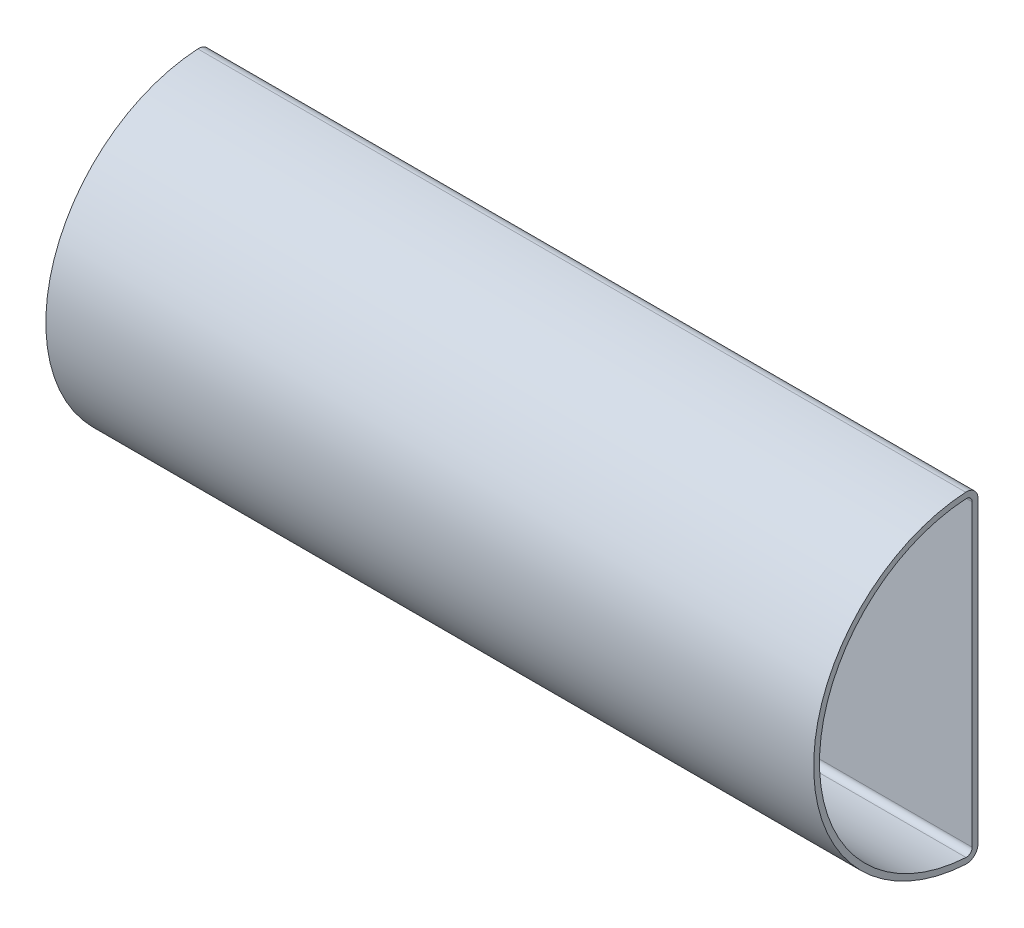
ISO-10303-21;
HEADER;
FILE_DESCRIPTION(('STEP AP214'),'2;1');
FILE_NAME('part.step','',(''),(''),'','','');
FILE_SCHEMA(('AUTOMOTIVE_DESIGN { 1 0 10303 214 1 1 1 1 }'));
ENDSEC;
DATA;
#1=APPLICATION_CONTEXT('core data for automotive mechanical design processes');
#2=APPLICATION_PROTOCOL_DEFINITION('international standard','automotive_design',2000,#1);
#3=PRODUCT_CONTEXT('',#1,'mechanical');
#4=PRODUCT('Part','Part','',(#3));
#5=PRODUCT_RELATED_PRODUCT_CATEGORY('part','',(#4));
#6=PRODUCT_DEFINITION_FORMATION('','',#4);
#7=PRODUCT_DEFINITION_CONTEXT('part definition',#1,'design');
#8=PRODUCT_DEFINITION('design','',#6,#7);
#9=PRODUCT_DEFINITION_SHAPE('','',#8);
#10=(LENGTH_UNIT() NAMED_UNIT(*) SI_UNIT(.MILLI.,.METRE.));
#11=(NAMED_UNIT(*) PLANE_ANGLE_UNIT() SI_UNIT($,.RADIAN.));
#12=(NAMED_UNIT(*) SI_UNIT($,.STERADIAN.) SOLID_ANGLE_UNIT());
#13=UNCERTAINTY_MEASURE_WITH_UNIT(LENGTH_MEASURE(1.E-05),#10,'distance_accuracy_value','');
#14=(GEOMETRIC_REPRESENTATION_CONTEXT(3) GLOBAL_UNCERTAINTY_ASSIGNED_CONTEXT((#13)) GLOBAL_UNIT_ASSIGNED_CONTEXT((#10,
#11,#12)) REPRESENTATION_CONTEXT('',''));
#15=CARTESIAN_POINT('',(0.,0.,0.));
#16=DIRECTION('',(0.,0.,1.));
#17=DIRECTION('',(1.,0.,0.));
#18=AXIS2_PLACEMENT_3D('',#15,#16,#17);
#19=CARTESIAN_POINT('',(264.,51.4125471067132,11.7835658593735));
#20=DIRECTION('',(1.,0.,0.));
#21=DIRECTION('',(0.,0.,-1.));
#22=AXIS2_PLACEMENT_3D('',#19,#20,#21);
#23=PLANE('',#22);
#24=CARTESIAN_POINT('',(264.,51.4125471067132,11.7835658593735));
#25=DIRECTION('',(1.,0.,0.));
#26=DIRECTION('',(0.,0.,-1.));
#27=AXIS2_PLACEMENT_3D('',#24,#25,#26);
#28=CIRCLE('',#27,4.);
#29=CARTESIAN_POINT('',(264.,51.4125471067132,7.78356585937351));
#30=VERTEX_POINT('',#29);
#31=CARTESIAN_POINT('',(264.,55.4057546489822,12.0165755681114));
#32=VERTEX_POINT('',#31);
#33=EDGE_CURVE('E134',#30,#32,#28,.T.);
#34=ORIENTED_EDGE('',*,*,#33,.T.);
#35=CARTESIAN_POINT('',(264.,0.,8.78356585937348));
#36=DIRECTION('',(1.,0.,0.));
#37=DIRECTION('',(0.,0.,-1.));
#38=AXIS2_PLACEMENT_3D('',#35,#36,#37);
#39=CIRCLE('',#38,55.5);
#40=CARTESIAN_POINT('',(264.,-55.4057546489821,12.0165755681113));
#41=VERTEX_POINT('',#40);
#42=EDGE_CURVE('E137',#32,#41,#39,.T.);
#43=ORIENTED_EDGE('',*,*,#42,.T.);
#44=CARTESIAN_POINT('',(264.,-51.4125471067132,11.7835658593735));
#45=DIRECTION('',(1.,0.,0.));
#46=DIRECTION('',(0.,0.,1.));
#47=AXIS2_PLACEMENT_3D('',#44,#45,#46);
#48=CIRCLE('',#47,3.99999999999998);
#49=CARTESIAN_POINT('',(264.,-51.4125471067132,7.78356585937351));
#50=VERTEX_POINT('',#49);
#51=EDGE_CURVE('E140',#41,#50,#48,.T.);
#52=ORIENTED_EDGE('',*,*,#51,.T.);
#53=DIRECTION('',(0.,1.,0.));
#54=VECTOR('',#53,1.);
#55=CARTESIAN_POINT('',(264.,51.4125471067132,7.78356585937351));
#56=LINE('',#55,#54);
#57=EDGE_CURVE('E142',#50,#30,#56,.T.);
#58=ORIENTED_EDGE('',*,*,#57,.T.);
#59=EDGE_LOOP('',(#34,#43,#52,#58));
#60=FACE_BOUND('',#59,.T.);
#61=CARTESIAN_POINT('',(264.,0.,8.78356585937348));
#62=DIRECTION('',(1.,0.,0.));
#63=DIRECTION('',(0.,0.,-1.));
#64=AXIS2_PLACEMENT_3D('',#61,#62,#63);
#65=CIRCLE('',#64,53.5);
#66=CARTESIAN_POINT('',(264.,53.4091508778477,11.9000707137424));
#67=VERTEX_POINT('',#66);
#68=CARTESIAN_POINT('',(264.,-53.4091508778477,11.9000707137424));
#69=VERTEX_POINT('',#68);
#70=EDGE_CURVE('E106',#67,#69,#65,.T.);
#71=ORIENTED_EDGE('',*,*,#70,.F.);
#72=CARTESIAN_POINT('',(264.,51.4125471067132,11.7835658593735));
#73=DIRECTION('',(1.,0.,0.));
#74=DIRECTION('',(0.,0.,-1.));
#75=AXIS2_PLACEMENT_3D('',#72,#73,#74);
#76=CIRCLE('',#75,2.);
#77=CARTESIAN_POINT('',(264.,51.4125471067132,9.78356585937351));
#78=VERTEX_POINT('',#77);
#79=EDGE_CURVE('E98',#78,#67,#76,.T.);
#80=ORIENTED_EDGE('',*,*,#79,.F.);
#81=DIRECTION('',(0.,1.,0.));
#82=VECTOR('',#81,1.);
#83=CARTESIAN_POINT('',(264.,51.4125471067132,9.78356585937351));
#84=LINE('',#83,#82);
#85=CARTESIAN_POINT('',(264.,-51.4125471067132,9.78356585937351));
#86=VERTEX_POINT('',#85);
#87=EDGE_CURVE('E120',#86,#78,#84,.T.);
#88=ORIENTED_EDGE('',*,*,#87,.F.);
#89=CARTESIAN_POINT('',(264.,-51.4125471067132,11.7835658593735));
#90=DIRECTION('',(1.,0.,0.));
#91=DIRECTION('',(0.,0.,1.));
#92=AXIS2_PLACEMENT_3D('',#89,#90,#91);
#93=CIRCLE('',#92,1.99999999999998);
#94=EDGE_CURVE('E118',#69,#86,#93,.T.);
#95=ORIENTED_EDGE('',*,*,#94,.F.);
#96=EDGE_LOOP('',(#71,#80,#88,#95));
#97=FACE_BOUND('',#96,.T.);
#98=ADVANCED_FACE('F33',(#60,#97),#23,.T.);
#99=CARTESIAN_POINT('',(0.,51.4125471067132,11.7835658593735));
#100=DIRECTION('',(1.,0.,0.));
#101=DIRECTION('',(0.,0.,-1.));
#102=AXIS2_PLACEMENT_3D('',#99,#100,#101);
#103=PLANE('',#102);
#104=CARTESIAN_POINT('',(0.,51.4125471067132,11.7835658593735));
#105=DIRECTION('',(1.,0.,0.));
#106=DIRECTION('',(0.,0.,-1.));
#107=AXIS2_PLACEMENT_3D('',#104,#105,#106);
#108=CIRCLE('',#107,4.);
#109=CARTESIAN_POINT('',(0.,51.4125471067132,7.78356585937351));
#110=VERTEX_POINT('',#109);
#111=CARTESIAN_POINT('',(0.,55.4057546489822,12.0165755681114));
#112=VERTEX_POINT('',#111);
#113=EDGE_CURVE('E114',#110,#112,#108,.T.);
#114=ORIENTED_EDGE('',*,*,#113,.F.);
#115=DIRECTION('',(0.,1.,0.));
#116=VECTOR('',#115,1.);
#117=CARTESIAN_POINT('',(0.,51.4125471067132,7.78356585937351));
#118=LINE('',#117,#116);
#119=CARTESIAN_POINT('',(0.,-51.4125471067132,7.78356585937351));
#120=VERTEX_POINT('',#119);
#121=EDGE_CURVE('E138',#120,#110,#118,.T.);
#122=ORIENTED_EDGE('',*,*,#121,.F.);
#123=CARTESIAN_POINT('',(0.,-51.4125471067132,11.7835658593735));
#124=DIRECTION('',(1.,0.,0.));
#125=DIRECTION('',(0.,0.,1.));
#126=AXIS2_PLACEMENT_3D('',#123,#124,#125);
#127=CIRCLE('',#126,3.99999999999998);
#128=CARTESIAN_POINT('',(0.,-55.4057546489821,12.0165755681113));
#129=VERTEX_POINT('',#128);
#130=EDGE_CURVE('E149',#129,#120,#127,.T.);
#131=ORIENTED_EDGE('',*,*,#130,.F.);
#132=CARTESIAN_POINT('',(0.,0.,8.78356585937348));
#133=DIRECTION('',(1.,0.,0.));
#134=DIRECTION('',(0.,0.,-1.));
#135=AXIS2_PLACEMENT_3D('',#132,#133,#134);
#136=CIRCLE('',#135,55.5);
#137=EDGE_CURVE('E147',#112,#129,#136,.T.);
#138=ORIENTED_EDGE('',*,*,#137,.F.);
#139=EDGE_LOOP('',(#114,#122,#131,#138));
#140=FACE_BOUND('',#139,.T.);
#141=CARTESIAN_POINT('',(0.,51.4125471067132,11.7835658593735));
#142=DIRECTION('',(1.,0.,0.));
#143=DIRECTION('',(0.,0.,-1.));
#144=AXIS2_PLACEMENT_3D('',#141,#142,#143);
#145=CIRCLE('',#144,2.);
#146=CARTESIAN_POINT('',(0.,51.4125471067132,9.78356585937351));
#147=VERTEX_POINT('',#146);
#148=CARTESIAN_POINT('',(0.,53.4091508778477,11.9000707137424));
#149=VERTEX_POINT('',#148);
#150=EDGE_CURVE('E56',#147,#149,#145,.T.);
#151=ORIENTED_EDGE('',*,*,#150,.T.);
#152=CARTESIAN_POINT('',(0.,0.,8.78356585937348));
#153=DIRECTION('',(1.,0.,0.));
#154=DIRECTION('',(0.,0.,-1.));
#155=AXIS2_PLACEMENT_3D('',#152,#153,#154);
#156=CIRCLE('',#155,53.5);
#157=CARTESIAN_POINT('',(0.,-53.4091508778477,11.9000707137424));
#158=VERTEX_POINT('',#157);
#159=EDGE_CURVE('E113',#149,#158,#156,.T.);
#160=ORIENTED_EDGE('',*,*,#159,.T.);
#161=CARTESIAN_POINT('',(0.,-51.4125471067132,11.7835658593735));
#162=DIRECTION('',(1.,0.,0.));
#163=DIRECTION('',(0.,0.,1.));
#164=AXIS2_PLACEMENT_3D('',#161,#162,#163);
#165=CIRCLE('',#164,1.99999999999998);
#166=CARTESIAN_POINT('',(0.,-51.4125471067132,9.78356585937351));
#167=VERTEX_POINT('',#166);
#168=EDGE_CURVE('E126',#158,#167,#165,.T.);
#169=ORIENTED_EDGE('',*,*,#168,.T.);
#170=DIRECTION('',(0.,1.,0.));
#171=VECTOR('',#170,1.);
#172=CARTESIAN_POINT('',(0.,51.4125471067132,9.78356585937351));
#173=LINE('',#172,#171);
#174=EDGE_CURVE('E107',#167,#147,#173,.T.);
#175=ORIENTED_EDGE('',*,*,#174,.T.);
#176=EDGE_LOOP('',(#151,#160,#169,#175));
#177=FACE_BOUND('',#176,.T.);
#178=ADVANCED_FACE('F167',(#140,#177),#103,.F.);
#179=CARTESIAN_POINT('',(264.,51.4125471067132,11.7835658593735));
#180=DIRECTION('',(-1.,0.,0.));
#181=DIRECTION('',(0.,0.,1.));
#182=AXIS2_PLACEMENT_3D('',#179,#180,#181);
#183=CYLINDRICAL_SURFACE('',#182,4.);
#184=ORIENTED_EDGE('',*,*,#113,.T.);
#185=DIRECTION('',(-1.,0.,0.));
#186=VECTOR('',#185,1.);
#187=CARTESIAN_POINT('',(264.,55.4057546489822,12.0165755681114));
#188=LINE('',#187,#186);
#189=EDGE_CURVE('E11',#32,#112,#188,.T.);
#190=ORIENTED_EDGE('',*,*,#189,.F.);
#191=ORIENTED_EDGE('',*,*,#33,.F.);
#192=DIRECTION('',(-1.,0.,0.));
#193=VECTOR('',#192,1.);
#194=CARTESIAN_POINT('',(264.,51.4125471067132,7.78356585937351));
#195=LINE('',#194,#193);
#196=EDGE_CURVE('E144',#30,#110,#195,.T.);
#197=ORIENTED_EDGE('',*,*,#196,.T.);
#198=EDGE_LOOP('',(#184,#190,#191,#197));
#199=FACE_BOUND('',#198,.T.);
#200=ADVANCED_FACE('F35',(#199),#183,.T.);
#201=CARTESIAN_POINT('',(264.,0.,8.78356585937348));
#202=DIRECTION('',(-1.,0.,0.));
#203=DIRECTION('',(0.,0.,1.));
#204=AXIS2_PLACEMENT_3D('',#201,#202,#203);
#205=CYLINDRICAL_SURFACE('',#204,55.5);
#206=ORIENTED_EDGE('',*,*,#137,.T.);
#207=DIRECTION('',(-1.,0.,0.));
#208=VECTOR('',#207,1.);
#209=CARTESIAN_POINT('',(264.,-55.4057546489821,12.0165755681113));
#210=LINE('',#209,#208);
#211=EDGE_CURVE('E41',#41,#129,#210,.T.);
#212=ORIENTED_EDGE('',*,*,#211,.F.);
#213=ORIENTED_EDGE('',*,*,#42,.F.);
#214=ORIENTED_EDGE('',*,*,#189,.T.);
#215=EDGE_LOOP('',(#206,#212,#213,#214));
#216=FACE_BOUND('',#215,.T.);
#217=ADVANCED_FACE('F177',(#216),#205,.T.);
#218=CARTESIAN_POINT('',(264.,-51.4125471067132,11.7835658593735));
#219=DIRECTION('',(-1.,0.,0.));
#220=DIRECTION('',(0.,0.,1.));
#221=AXIS2_PLACEMENT_3D('',#218,#219,#220);
#222=CYLINDRICAL_SURFACE('',#221,3.99999999999998);
#223=ORIENTED_EDGE('',*,*,#130,.T.);
#224=DIRECTION('',(-1.,0.,0.));
#225=VECTOR('',#224,1.);
#226=CARTESIAN_POINT('',(264.,-51.4125471067132,7.78356585937351));
#227=LINE('',#226,#225);
#228=EDGE_CURVE('E154',#50,#120,#227,.T.);
#229=ORIENTED_EDGE('',*,*,#228,.F.);
#230=ORIENTED_EDGE('',*,*,#51,.F.);
#231=ORIENTED_EDGE('',*,*,#211,.T.);
#232=EDGE_LOOP('',(#223,#229,#230,#231));
#233=FACE_BOUND('',#232,.T.);
#234=ADVANCED_FACE('F161',(#233),#222,.T.);
#235=CARTESIAN_POINT('',(264.,51.4125471067132,7.78356585937351));
#236=DIRECTION('',(0.,0.,1.));
#237=DIRECTION('',(1.,0.,0.));
#238=AXIS2_PLACEMENT_3D('',#235,#236,#237);
#239=PLANE('',#238);
#240=ORIENTED_EDGE('',*,*,#121,.T.);
#241=ORIENTED_EDGE('',*,*,#196,.F.);
#242=ORIENTED_EDGE('',*,*,#57,.F.);
#243=ORIENTED_EDGE('',*,*,#228,.T.);
#244=EDGE_LOOP('',(#240,#241,#242,#243));
#245=FACE_BOUND('',#244,.T.);
#246=ADVANCED_FACE('F171',(#245),#239,.F.);
#247=CARTESIAN_POINT('',(264.,51.4125471067132,11.7835658593735));
#248=DIRECTION('',(-1.,0.,0.));
#249=DIRECTION('',(0.,0.,1.));
#250=AXIS2_PLACEMENT_3D('',#247,#248,#249);
#251=CYLINDRICAL_SURFACE('',#250,2.);
#252=ORIENTED_EDGE('',*,*,#150,.F.);
#253=DIRECTION('',(-1.,0.,0.));
#254=VECTOR('',#253,1.);
#255=CARTESIAN_POINT('',(264.,51.4125471067132,9.78356585937351));
#256=LINE('',#255,#254);
#257=EDGE_CURVE('E102',#78,#147,#256,.T.);
#258=ORIENTED_EDGE('',*,*,#257,.F.);
#259=ORIENTED_EDGE('',*,*,#79,.T.);
#260=DIRECTION('',(-1.,0.,0.));
#261=VECTOR('',#260,1.);
#262=CARTESIAN_POINT('',(264.,53.4091508778477,11.9000707137424));
#263=LINE('',#262,#261);
#264=EDGE_CURVE('E101',#67,#149,#263,.T.);
#265=ORIENTED_EDGE('',*,*,#264,.T.);
#266=EDGE_LOOP('',(#252,#258,#259,#265));
#267=FACE_BOUND('',#266,.T.);
#268=ADVANCED_FACE('F100',(#267),#251,.F.);
#269=CARTESIAN_POINT('',(264.,0.,8.78356585937348));
#270=DIRECTION('',(-1.,0.,0.));
#271=DIRECTION('',(0.,0.,1.));
#272=AXIS2_PLACEMENT_3D('',#269,#270,#271);
#273=CYLINDRICAL_SURFACE('',#272,53.5);
#274=ORIENTED_EDGE('',*,*,#159,.F.);
#275=ORIENTED_EDGE('',*,*,#264,.F.);
#276=ORIENTED_EDGE('',*,*,#70,.T.);
#277=DIRECTION('',(-1.,0.,0.));
#278=VECTOR('',#277,1.);
#279=CARTESIAN_POINT('',(264.,-53.4091508778477,11.9000707137424));
#280=LINE('',#279,#278);
#281=EDGE_CURVE('E115',#69,#158,#280,.T.);
#282=ORIENTED_EDGE('',*,*,#281,.T.);
#283=EDGE_LOOP('',(#274,#275,#276,#282));
#284=FACE_BOUND('',#283,.T.);
#285=ADVANCED_FACE('F110',(#284),#273,.F.);
#286=CARTESIAN_POINT('',(264.,-51.4125471067132,11.7835658593735));
#287=DIRECTION('',(-1.,0.,0.));
#288=DIRECTION('',(0.,0.,1.));
#289=AXIS2_PLACEMENT_3D('',#286,#287,#288);
#290=CYLINDRICAL_SURFACE('',#289,1.99999999999998);
#291=ORIENTED_EDGE('',*,*,#168,.F.);
#292=ORIENTED_EDGE('',*,*,#281,.F.);
#293=ORIENTED_EDGE('',*,*,#94,.T.);
#294=DIRECTION('',(-1.,0.,0.));
#295=VECTOR('',#294,1.);
#296=CARTESIAN_POINT('',(264.,-51.4125471067132,9.78356585937351));
#297=LINE('',#296,#295);
#298=EDGE_CURVE('E48',#86,#167,#297,.T.);
#299=ORIENTED_EDGE('',*,*,#298,.T.);
#300=EDGE_LOOP('',(#291,#292,#293,#299));
#301=FACE_BOUND('',#300,.T.);
#302=ADVANCED_FACE('F200',(#301),#290,.F.);
#303=CARTESIAN_POINT('',(264.,51.4125471067132,9.78356585937351));
#304=DIRECTION('',(0.,0.,1.));
#305=DIRECTION('',(1.,0.,0.));
#306=AXIS2_PLACEMENT_3D('',#303,#304,#305);
#307=PLANE('',#306);
#308=ORIENTED_EDGE('',*,*,#174,.F.);
#309=ORIENTED_EDGE('',*,*,#298,.F.);
#310=ORIENTED_EDGE('',*,*,#87,.T.);
#311=ORIENTED_EDGE('',*,*,#257,.T.);
#312=EDGE_LOOP('',(#308,#309,#310,#311));
#313=FACE_BOUND('',#312,.T.);
#314=ADVANCED_FACE('F204',(#313),#307,.T.);
#315=CLOSED_SHELL('',(#98,#178,#200,#217,#234,#246,#268,#285,#302,#314));
#316=MANIFOLD_SOLID_BREP('B2',#315);
#317=ADVANCED_BREP_SHAPE_REPRESENTATION('',(#18,#316),#14);
#318=SHAPE_DEFINITION_REPRESENTATION(#9,#317);
ENDSEC;
END-ISO-10303-21;
